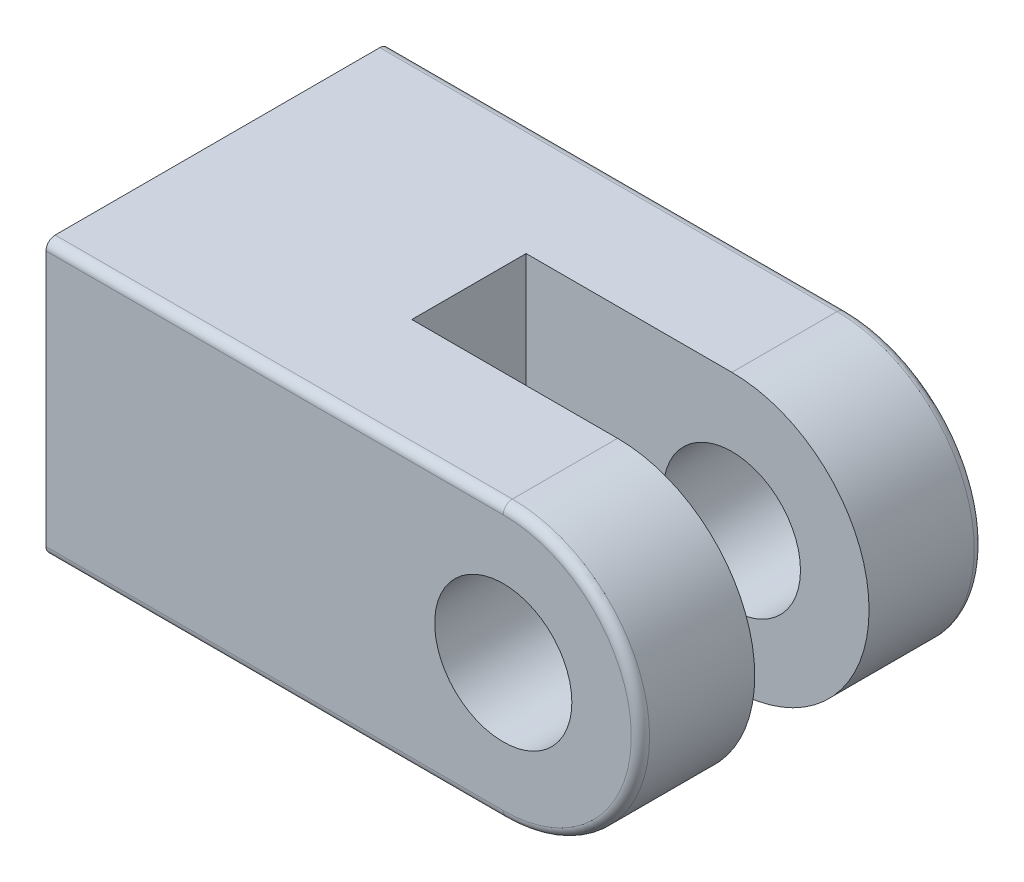
ISO-10303-21;
HEADER;
FILE_DESCRIPTION(('STEP AP214'),'2;1');
FILE_NAME('part.step','',(''),(''),'','','');
FILE_SCHEMA(('AUTOMOTIVE_DESIGN { 1 0 10303 214 1 1 1 1 }'));
ENDSEC;
DATA;
#1=APPLICATION_CONTEXT('core data for automotive mechanical design processes');
#2=APPLICATION_PROTOCOL_DEFINITION('international standard','automotive_design',2000,#1);
#3=PRODUCT_CONTEXT('',#1,'mechanical');
#4=PRODUCT('Part','Part','',(#3));
#5=PRODUCT_RELATED_PRODUCT_CATEGORY('part','',(#4));
#6=PRODUCT_DEFINITION_FORMATION('','',#4);
#7=PRODUCT_DEFINITION_CONTEXT('part definition',#1,'design');
#8=PRODUCT_DEFINITION('design','',#6,#7);
#9=PRODUCT_DEFINITION_SHAPE('','',#8);
#10=(LENGTH_UNIT() NAMED_UNIT(*) SI_UNIT(.MILLI.,.METRE.));
#11=(NAMED_UNIT(*) PLANE_ANGLE_UNIT() SI_UNIT($,.RADIAN.));
#12=(NAMED_UNIT(*) SI_UNIT($,.STERADIAN.) SOLID_ANGLE_UNIT());
#13=UNCERTAINTY_MEASURE_WITH_UNIT(LENGTH_MEASURE(1.E-05),#10,'distance_accuracy_value','');
#14=(GEOMETRIC_REPRESENTATION_CONTEXT(3) GLOBAL_UNCERTAINTY_ASSIGNED_CONTEXT((#13)) GLOBAL_UNIT_ASSIGNED_CONTEXT((#10,
#11,#12)) REPRESENTATION_CONTEXT('',''));
#15=CARTESIAN_POINT('',(0.,0.,0.));
#16=DIRECTION('',(0.,0.,1.));
#17=DIRECTION('',(1.,0.,0.));
#18=AXIS2_PLACEMENT_3D('',#15,#16,#17);
#19=CARTESIAN_POINT('',(0.,0.,19.05));
#20=DIRECTION('',(0.,0.,-1.));
#21=DIRECTION('',(-1.,0.,0.));
#22=AXIS2_PLACEMENT_3D('',#19,#20,#21);
#23=CYLINDRICAL_SURFACE('',#22,7.62);
#24=DIRECTION('',(0.,0.,-1.));
#25=VECTOR('',#24,1.);
#26=CARTESIAN_POINT('',(0.,7.62,19.05));
#27=LINE('',#26,#25);
#28=CARTESIAN_POINT('',(0.,7.62,18.542));
#29=VERTEX_POINT('',#28);
#30=CARTESIAN_POINT('',(0.,7.62,12.7));
#31=VERTEX_POINT('',#30);
#32=EDGE_CURVE('E180',#29,#31,#27,.T.);
#33=ORIENTED_EDGE('',*,*,#32,.F.);
#34=CARTESIAN_POINT('',(0.,0.,18.542));
#35=DIRECTION('',(0.,0.,1.));
#36=DIRECTION('',(1.,0.,0.));
#37=AXIS2_PLACEMENT_3D('',#34,#35,#36);
#38=CIRCLE('',#37,7.62);
#39=CARTESIAN_POINT('',(0.,-7.62,18.542));
#40=VERTEX_POINT('',#39);
#41=EDGE_CURVE('E11',#29,#40,#38,.F.);
#42=ORIENTED_EDGE('',*,*,#41,.T.);
#43=DIRECTION('',(0.,0.,-1.));
#44=VECTOR('',#43,1.);
#45=CARTESIAN_POINT('',(0.,-7.62,19.05));
#46=LINE('',#45,#44);
#47=CARTESIAN_POINT('',(0.,-7.62,12.7));
#48=VERTEX_POINT('',#47);
#49=EDGE_CURVE('E171',#40,#48,#46,.T.);
#50=ORIENTED_EDGE('',*,*,#49,.T.);
#51=CARTESIAN_POINT('',(0.,0.,12.7));
#52=DIRECTION('',(0.,0.,1.));
#53=DIRECTION('',(1.,0.,0.));
#54=AXIS2_PLACEMENT_3D('',#51,#52,#53);
#55=CIRCLE('',#54,7.62);
#56=EDGE_CURVE('E161',#48,#31,#55,.T.);
#57=ORIENTED_EDGE('',*,*,#56,.T.);
#58=EDGE_LOOP('',(#33,#42,#50,#57));
#59=FACE_BOUND('',#58,.T.);
#60=ADVANCED_FACE('F34',(#59),#23,.T.);
#61=CARTESIAN_POINT('',(0.,-7.62,6.35));
#62=VERTEX_POINT('',#61);
#63=CARTESIAN_POINT('',(0.,-7.62,0.508000000000008));
#64=VERTEX_POINT('',#63);
#65=EDGE_CURVE('E168',#62,#64,#46,.T.);
#66=ORIENTED_EDGE('',*,*,#65,.T.);
#67=CARTESIAN_POINT('',(0.,0.,0.508000000000002));
#68=DIRECTION('',(0.,0.,1.));
#69=DIRECTION('',(1.,0.,0.));
#70=AXIS2_PLACEMENT_3D('',#67,#68,#69);
#71=CIRCLE('',#70,7.62);
#72=CARTESIAN_POINT('',(0.,7.62,0.508000000000008));
#73=VERTEX_POINT('',#72);
#74=EDGE_CURVE('E43',#64,#73,#71,.T.);
#75=ORIENTED_EDGE('',*,*,#74,.T.);
#76=CARTESIAN_POINT('',(0.,7.62,6.35));
#77=VERTEX_POINT('',#76);
#78=EDGE_CURVE('E179',#77,#73,#27,.T.);
#79=ORIENTED_EDGE('',*,*,#78,.F.);
#80=CARTESIAN_POINT('',(0.,0.,6.35));
#81=DIRECTION('',(0.,0.,-1.));
#82=DIRECTION('',(-1.,0.,0.));
#83=AXIS2_PLACEMENT_3D('',#80,#81,#82);
#84=CIRCLE('',#83,7.62);
#85=EDGE_CURVE('E132',#77,#62,#84,.T.);
#86=ORIENTED_EDGE('',*,*,#85,.T.);
#87=EDGE_LOOP('',(#66,#75,#79,#86));
#88=FACE_BOUND('',#87,.T.);
#89=ADVANCED_FACE('F252',(#88),#23,.T.);
#90=CARTESIAN_POINT('',(0.,7.62,19.05));
#91=DIRECTION('',(0.,-1.,0.));
#92=DIRECTION('',(1.,0.,0.));
#93=AXIS2_PLACEMENT_3D('',#90,#91,#92);
#94=PLANE('',#93);
#95=ORIENTED_EDGE('',*,*,#78,.T.);
#96=DIRECTION('',(-1.,0.,0.));
#97=VECTOR('',#96,1.);
#98=CARTESIAN_POINT('',(0.,7.62,0.508000000000002));
#99=LINE('',#98,#97);
#100=CARTESIAN_POINT('',(-25.4,7.62,0.508000000000008));
#101=VERTEX_POINT('',#100);
#102=EDGE_CURVE('E209',#73,#101,#99,.T.);
#103=ORIENTED_EDGE('',*,*,#102,.T.);
#104=DIRECTION('',(0.,0.,-1.));
#105=VECTOR('',#104,1.);
#106=CARTESIAN_POINT('',(-25.4,7.62,19.05));
#107=LINE('',#106,#105);
#108=CARTESIAN_POINT('',(-25.4,7.62,18.542));
#109=VERTEX_POINT('',#108);
#110=EDGE_CURVE('E176',#109,#101,#107,.T.);
#111=ORIENTED_EDGE('',*,*,#110,.F.);
#112=DIRECTION('',(-1.,0.,0.));
#113=VECTOR('',#112,1.);
#114=CARTESIAN_POINT('',(0.,7.62,18.542));
#115=LINE('',#114,#113);
#116=EDGE_CURVE('E207',#109,#29,#115,.F.);
#117=ORIENTED_EDGE('',*,*,#116,.T.);
#118=ORIENTED_EDGE('',*,*,#32,.T.);
#119=DIRECTION('',(1.,0.,0.));
#120=VECTOR('',#119,1.);
#121=CARTESIAN_POINT('',(-11.43,7.62,12.7));
#122=LINE('',#121,#120);
#123=CARTESIAN_POINT('',(-11.43,7.62,12.7));
#124=VERTEX_POINT('',#123);
#125=EDGE_CURVE('E151',#124,#31,#122,.T.);
#126=ORIENTED_EDGE('',*,*,#125,.F.);
#127=DIRECTION('',(0.,0.,1.));
#128=VECTOR('',#127,1.);
#129=CARTESIAN_POINT('',(-11.43,7.62,6.35));
#130=LINE('',#129,#128);
#131=CARTESIAN_POINT('',(-11.43,7.62,6.35));
#132=VERTEX_POINT('',#131);
#133=EDGE_CURVE('E137',#132,#124,#130,.T.);
#134=ORIENTED_EDGE('',*,*,#133,.F.);
#135=DIRECTION('',(-1.,0.,0.));
#136=VECTOR('',#135,1.);
#137=CARTESIAN_POINT('',(7.62,7.62,6.35));
#138=LINE('',#137,#136);
#139=EDGE_CURVE('E126',#77,#132,#138,.T.);
#140=ORIENTED_EDGE('',*,*,#139,.F.);
#141=EDGE_LOOP('',(#95,#103,#111,#117,#118,#126,#134,#140));
#142=FACE_BOUND('',#141,.T.);
#143=ADVANCED_FACE('F149',(#142),#94,.F.);
#144=CARTESIAN_POINT('',(-25.4,7.62,19.05));
#145=DIRECTION('',(1.,0.,0.));
#146=DIRECTION('',(0.,0.,-1.));
#147=AXIS2_PLACEMENT_3D('',#144,#145,#146);
#148=PLANE('',#147);
#149=DIRECTION('',(0.,-1.,0.));
#150=VECTOR('',#149,1.);
#151=CARTESIAN_POINT('',(-25.4,7.62,0.));
#152=LINE('',#151,#150);
#153=CARTESIAN_POINT('',(-25.4,7.112,0.));
#154=VERTEX_POINT('',#153);
#155=CARTESIAN_POINT('',(-25.4,-7.112,0.));
#156=VERTEX_POINT('',#155);
#157=EDGE_CURVE('E164',#154,#156,#152,.T.);
#158=ORIENTED_EDGE('',*,*,#157,.T.);
#159=CARTESIAN_POINT('',(-25.4,-7.112,0.508000000000002));
#160=DIRECTION('',(1.,0.,0.));
#161=DIRECTION('',(0.,0.,-1.));
#162=AXIS2_PLACEMENT_3D('',#159,#160,#161);
#163=CIRCLE('',#162,0.508);
#164=CARTESIAN_POINT('',(-25.4,-7.62,0.508000000000008));
#165=VERTEX_POINT('',#164);
#166=EDGE_CURVE('E205',#156,#165,#163,.F.);
#167=ORIENTED_EDGE('',*,*,#166,.T.);
#168=DIRECTION('',(0.,0.,-1.));
#169=VECTOR('',#168,1.);
#170=CARTESIAN_POINT('',(-25.4,-7.62,19.05));
#171=LINE('',#170,#169);
#172=CARTESIAN_POINT('',(-25.4,-7.62,18.542));
#173=VERTEX_POINT('',#172);
#174=EDGE_CURVE('E173',#173,#165,#171,.T.);
#175=ORIENTED_EDGE('',*,*,#174,.F.);
#176=CARTESIAN_POINT('',(-25.4,-7.112,18.542));
#177=DIRECTION('',(1.,0.,0.));
#178=DIRECTION('',(0.,0.,-1.));
#179=AXIS2_PLACEMENT_3D('',#176,#177,#178);
#180=CIRCLE('',#179,0.508);
#181=CARTESIAN_POINT('',(-25.4,-7.112,19.05));
#182=VERTEX_POINT('',#181);
#183=EDGE_CURVE('E201',#173,#182,#180,.F.);
#184=ORIENTED_EDGE('',*,*,#183,.T.);
#185=DIRECTION('',(0.,-1.,0.));
#186=VECTOR('',#185,1.);
#187=CARTESIAN_POINT('',(-25.4,7.62,19.05));
#188=LINE('',#187,#186);
#189=CARTESIAN_POINT('',(-25.4,7.112,19.05));
#190=VERTEX_POINT('',#189);
#191=EDGE_CURVE('E165',#190,#182,#188,.T.);
#192=ORIENTED_EDGE('',*,*,#191,.F.);
#193=CARTESIAN_POINT('',(-25.4,7.112,18.542));
#194=DIRECTION('',(1.,0.,0.));
#195=DIRECTION('',(0.,0.,-1.));
#196=AXIS2_PLACEMENT_3D('',#193,#194,#195);
#197=CIRCLE('',#196,0.508);
#198=EDGE_CURVE('E199',#190,#109,#197,.F.);
#199=ORIENTED_EDGE('',*,*,#198,.T.);
#200=ORIENTED_EDGE('',*,*,#110,.T.);
#201=CARTESIAN_POINT('',(-25.4,7.112,0.508000000000002));
#202=DIRECTION('',(1.,0.,0.));
#203=DIRECTION('',(0.,0.,-1.));
#204=AXIS2_PLACEMENT_3D('',#201,#202,#203);
#205=CIRCLE('',#204,0.508);
#206=EDGE_CURVE('E203',#101,#154,#205,.F.);
#207=ORIENTED_EDGE('',*,*,#206,.T.);
#208=EDGE_LOOP('',(#158,#167,#175,#184,#192,#199,#200,#207));
#209=FACE_BOUND('',#208,.T.);
#210=ADVANCED_FACE('F234',(#209),#148,.F.);
#211=CARTESIAN_POINT('',(-25.4,-7.62,19.05));
#212=DIRECTION('',(0.,1.,0.));
#213=DIRECTION('',(0.,0.,1.));
#214=AXIS2_PLACEMENT_3D('',#211,#212,#213);
#215=PLANE('',#214);
#216=ORIENTED_EDGE('',*,*,#174,.T.);
#217=DIRECTION('',(1.,0.,0.));
#218=VECTOR('',#217,1.);
#219=CARTESIAN_POINT('',(-25.4,-7.62,0.508000000000002));
#220=LINE('',#219,#218);
#221=EDGE_CURVE('E190',#165,#64,#220,.T.);
#222=ORIENTED_EDGE('',*,*,#221,.T.);
#223=ORIENTED_EDGE('',*,*,#65,.F.);
#224=DIRECTION('',(-1.,0.,0.));
#225=VECTOR('',#224,1.);
#226=CARTESIAN_POINT('',(-25.4,-7.62,6.35));
#227=LINE('',#226,#225);
#228=CARTESIAN_POINT('',(-11.43,-7.62,6.35));
#229=VERTEX_POINT('',#228);
#230=EDGE_CURVE('E182',#62,#229,#227,.T.);
#231=ORIENTED_EDGE('',*,*,#230,.T.);
#232=DIRECTION('',(0.,0.,1.));
#233=VECTOR('',#232,1.);
#234=CARTESIAN_POINT('',(-11.43,-7.62,6.35));
#235=LINE('',#234,#233);
#236=CARTESIAN_POINT('',(-11.43,-7.62,12.7));
#237=VERTEX_POINT('',#236);
#238=EDGE_CURVE('E145',#229,#237,#235,.T.);
#239=ORIENTED_EDGE('',*,*,#238,.T.);
#240=DIRECTION('',(1.,0.,0.));
#241=VECTOR('',#240,1.);
#242=CARTESIAN_POINT('',(-11.43,-7.62,12.7));
#243=LINE('',#242,#241);
#244=EDGE_CURVE('E147',#237,#48,#243,.T.);
#245=ORIENTED_EDGE('',*,*,#244,.T.);
#246=ORIENTED_EDGE('',*,*,#49,.F.);
#247=DIRECTION('',(1.,0.,0.));
#248=VECTOR('',#247,1.);
#249=CARTESIAN_POINT('',(-25.4,-7.62,18.542));
#250=LINE('',#249,#248);
#251=EDGE_CURVE('E184',#40,#173,#250,.F.);
#252=ORIENTED_EDGE('',*,*,#251,.T.);
#253=EDGE_LOOP('',(#216,#222,#223,#231,#239,#245,#246,#252));
#254=FACE_BOUND('',#253,.T.);
#255=ADVANCED_FACE('F241',(#254),#215,.F.);
#256=CARTESIAN_POINT('',(0.,0.,19.05));
#257=DIRECTION('',(0.,0.,1.));
#258=DIRECTION('',(1.,0.,0.));
#259=AXIS2_PLACEMENT_3D('',#256,#257,#258);
#260=PLANE('',#259);
#261=ORIENTED_EDGE('',*,*,#191,.T.);
#262=DIRECTION('',(1.,0.,0.));
#263=VECTOR('',#262,1.);
#264=CARTESIAN_POINT('',(0.,-7.112,19.05));
#265=LINE('',#264,#263);
#266=CARTESIAN_POINT('',(0.,-7.112,19.05));
#267=VERTEX_POINT('',#266);
#268=EDGE_CURVE('E214',#182,#267,#265,.T.);
#269=ORIENTED_EDGE('',*,*,#268,.T.);
#270=CARTESIAN_POINT('',(0.,0.,19.05));
#271=DIRECTION('',(0.,0.,1.));
#272=DIRECTION('',(1.,0.,0.));
#273=AXIS2_PLACEMENT_3D('',#270,#271,#272);
#274=CIRCLE('',#273,7.112);
#275=CARTESIAN_POINT('',(0.,7.112,19.05));
#276=VERTEX_POINT('',#275);
#277=EDGE_CURVE('E51',#267,#276,#274,.T.);
#278=ORIENTED_EDGE('',*,*,#277,.T.);
#279=DIRECTION('',(-1.,0.,0.));
#280=VECTOR('',#279,1.);
#281=CARTESIAN_POINT('',(-25.4,7.112,19.05));
#282=LINE('',#281,#280);
#283=EDGE_CURVE('E212',#276,#190,#282,.T.);
#284=ORIENTED_EDGE('',*,*,#283,.T.);
#285=EDGE_LOOP('',(#261,#269,#278,#284));
#286=FACE_BOUND('',#285,.T.);
#287=CARTESIAN_POINT('',(0.,0.,19.05));
#288=DIRECTION('',(0.,0.,1.));
#289=DIRECTION('',(1.,0.,0.));
#290=AXIS2_PLACEMENT_3D('',#287,#288,#289);
#291=CIRCLE('',#290,3.81);
#292=CARTESIAN_POINT('',(3.81,0.,19.05));
#293=VERTEX_POINT('',#292);
#294=EDGE_CURVE('E221',#293,#293,#291,.T.);
#295=ORIENTED_EDGE('',*,*,#294,.F.);
#296=EDGE_LOOP('',(#295));
#297=FACE_BOUND('',#296,.T.);
#298=ADVANCED_FACE('F231',(#286,#297),#260,.T.);
#299=CARTESIAN_POINT('',(0.,0.,0.));
#300=DIRECTION('',(0.,0.,1.));
#301=DIRECTION('',(1.,0.,0.));
#302=AXIS2_PLACEMENT_3D('',#299,#300,#301);
#303=PLANE('',#302);
#304=CARTESIAN_POINT('',(0.,0.,0.));
#305=DIRECTION('',(0.,0.,1.));
#306=DIRECTION('',(1.,0.,0.));
#307=AXIS2_PLACEMENT_3D('',#304,#305,#306);
#308=CIRCLE('',#307,3.81);
#309=CARTESIAN_POINT('',(3.81,0.,0.));
#310=VERTEX_POINT('',#309);
#311=EDGE_CURVE('E188',#310,#310,#308,.T.);
#312=ORIENTED_EDGE('',*,*,#311,.T.);
#313=EDGE_LOOP('',(#312));
#314=FACE_BOUND('',#313,.T.);
#315=CARTESIAN_POINT('',(0.,0.,0.));
#316=DIRECTION('',(0.,0.,1.));
#317=DIRECTION('',(1.,0.,0.));
#318=AXIS2_PLACEMENT_3D('',#315,#316,#317);
#319=CIRCLE('',#318,7.112);
#320=CARTESIAN_POINT('',(0.,7.112,0.));
#321=VERTEX_POINT('',#320);
#322=CARTESIAN_POINT('',(0.,-7.112,0.));
#323=VERTEX_POINT('',#322);
#324=EDGE_CURVE('E193',#321,#323,#319,.F.);
#325=ORIENTED_EDGE('',*,*,#324,.T.);
#326=DIRECTION('',(1.,0.,0.));
#327=VECTOR('',#326,1.);
#328=CARTESIAN_POINT('',(0.,-7.112,0.));
#329=LINE('',#328,#327);
#330=EDGE_CURVE('E197',#323,#156,#329,.F.);
#331=ORIENTED_EDGE('',*,*,#330,.T.);
#332=ORIENTED_EDGE('',*,*,#157,.F.);
#333=DIRECTION('',(-1.,0.,0.));
#334=VECTOR('',#333,1.);
#335=CARTESIAN_POINT('',(0.,7.112,0.));
#336=LINE('',#335,#334);
#337=EDGE_CURVE('E195',#154,#321,#336,.F.);
#338=ORIENTED_EDGE('',*,*,#337,.T.);
#339=EDGE_LOOP('',(#325,#331,#332,#338));
#340=FACE_BOUND('',#339,.T.);
#341=ADVANCED_FACE('F266',(#314,#340),#303,.F.);
#342=CARTESIAN_POINT('',(-11.43,-7.62,12.7));
#343=DIRECTION('',(0.,0.,1.));
#344=DIRECTION('',(1.,0.,0.));
#345=AXIS2_PLACEMENT_3D('',#342,#343,#344);
#346=PLANE('',#345);
#347=CARTESIAN_POINT('',(0.,0.,12.7));
#348=DIRECTION('',(0.,0.,1.));
#349=DIRECTION('',(1.,0.,0.));
#350=AXIS2_PLACEMENT_3D('',#347,#348,#349);
#351=CIRCLE('',#350,3.81);
#352=CARTESIAN_POINT('',(3.81,0.,12.7));
#353=VERTEX_POINT('',#352);
#354=EDGE_CURVE('E138',#353,#353,#351,.T.);
#355=ORIENTED_EDGE('',*,*,#354,.T.);
#356=EDGE_LOOP('',(#355));
#357=FACE_BOUND('',#356,.T.);
#358=ORIENTED_EDGE('',*,*,#56,.F.);
#359=ORIENTED_EDGE('',*,*,#244,.F.);
#360=DIRECTION('',(0.,1.,0.));
#361=VECTOR('',#360,1.);
#362=CARTESIAN_POINT('',(-11.43,-7.62,12.7));
#363=LINE('',#362,#361);
#364=EDGE_CURVE('E146',#237,#124,#363,.T.);
#365=ORIENTED_EDGE('',*,*,#364,.T.);
#366=ORIENTED_EDGE('',*,*,#125,.T.);
#367=EDGE_LOOP('',(#358,#359,#365,#366));
#368=FACE_BOUND('',#367,.T.);
#369=ADVANCED_FACE('F248',(#357,#368),#346,.F.);
#370=CARTESIAN_POINT('',(7.62,-7.62,6.35));
#371=DIRECTION('',(0.,0.,-1.));
#372=DIRECTION('',(-1.,0.,0.));
#373=AXIS2_PLACEMENT_3D('',#370,#371,#372);
#374=PLANE('',#373);
#375=CARTESIAN_POINT('',(0.,0.,6.35));
#376=DIRECTION('',(0.,0.,-1.));
#377=DIRECTION('',(-1.,0.,0.));
#378=AXIS2_PLACEMENT_3D('',#375,#376,#377);
#379=CIRCLE('',#378,3.81);
#380=CARTESIAN_POINT('',(3.81,0.,6.35));
#381=VERTEX_POINT('',#380);
#382=EDGE_CURVE('E185',#381,#381,#379,.T.);
#383=ORIENTED_EDGE('',*,*,#382,.T.);
#384=EDGE_LOOP('',(#383));
#385=FACE_BOUND('',#384,.T.);
#386=ORIENTED_EDGE('',*,*,#139,.T.);
#387=DIRECTION('',(0.,1.,0.));
#388=VECTOR('',#387,1.);
#389=CARTESIAN_POINT('',(-11.43,-7.62,6.35));
#390=LINE('',#389,#388);
#391=EDGE_CURVE('E130',#229,#132,#390,.T.);
#392=ORIENTED_EDGE('',*,*,#391,.F.);
#393=ORIENTED_EDGE('',*,*,#230,.F.);
#394=ORIENTED_EDGE('',*,*,#85,.F.);
#395=EDGE_LOOP('',(#386,#392,#393,#394));
#396=FACE_BOUND('',#395,.T.);
#397=ADVANCED_FACE('F128',(#385,#396),#374,.F.);
#398=CARTESIAN_POINT('',(-11.43,-7.62,6.35));
#399=DIRECTION('',(-1.,0.,0.));
#400=DIRECTION('',(0.,0.,1.));
#401=AXIS2_PLACEMENT_3D('',#398,#399,#400);
#402=PLANE('',#401);
#403=ORIENTED_EDGE('',*,*,#364,.F.);
#404=ORIENTED_EDGE('',*,*,#238,.F.);
#405=ORIENTED_EDGE('',*,*,#391,.T.);
#406=ORIENTED_EDGE('',*,*,#133,.T.);
#407=EDGE_LOOP('',(#403,#404,#405,#406));
#408=FACE_BOUND('',#407,.T.);
#409=ADVANCED_FACE('F142',(#408),#402,.F.);
#410=CARTESIAN_POINT('',(0.,0.,0.));
#411=DIRECTION('',(0.,0.,1.));
#412=DIRECTION('',(1.,0.,0.));
#413=AXIS2_PLACEMENT_3D('',#410,#411,#412);
#414=CYLINDRICAL_SURFACE('',#413,3.81);
#415=CARTESIAN_POINT('',(3.81,0.,0.));
#416=CARTESIAN_POINT('',(3.81,0.,0.0661458333333333));
#417=CARTESIAN_POINT('',(3.81,0.,0.132291666666667));
#418=CARTESIAN_POINT('',(3.81,0.,0.264583333333333));
#419=CARTESIAN_POINT('',(3.81,0.,0.330729166666667));
#420=CARTESIAN_POINT('',(3.81,0.,0.463020833333333));
#421=CARTESIAN_POINT('',(3.81,0.,0.529166666666667));
#422=CARTESIAN_POINT('',(3.81,0.,0.661458333333333));
#423=CARTESIAN_POINT('',(3.81,0.,0.727604166666667));
#424=CARTESIAN_POINT('',(3.81,0.,0.859895833333333));
#425=CARTESIAN_POINT('',(3.81,0.,0.926041666666667));
#426=CARTESIAN_POINT('',(3.81,0.,1.05833333333333));
#427=CARTESIAN_POINT('',(3.81,0.,1.12447916666667));
#428=CARTESIAN_POINT('',(3.81,0.,1.25677083333333));
#429=CARTESIAN_POINT('',(3.81,0.,1.32291666666667));
#430=CARTESIAN_POINT('',(3.81,0.,1.45520833333333));
#431=CARTESIAN_POINT('',(3.81,0.,1.52135416666667));
#432=CARTESIAN_POINT('',(3.81,0.,1.65364583333333));
#433=CARTESIAN_POINT('',(3.81,0.,1.71979166666667));
#434=CARTESIAN_POINT('',(3.81,0.,1.85208333333333));
#435=CARTESIAN_POINT('',(3.81,0.,1.91822916666667));
#436=CARTESIAN_POINT('',(3.81,0.,2.05052083333333));
#437=CARTESIAN_POINT('',(3.81,0.,2.11666666666667));
#438=CARTESIAN_POINT('',(3.81,0.,2.24895833333333));
#439=CARTESIAN_POINT('',(3.81,0.,2.31510416666667));
#440=CARTESIAN_POINT('',(3.81,0.,2.44739583333333));
#441=CARTESIAN_POINT('',(3.81,0.,2.51354166666667));
#442=CARTESIAN_POINT('',(3.81,0.,2.64583333333333));
#443=CARTESIAN_POINT('',(3.81,0.,2.71197916666667));
#444=CARTESIAN_POINT('',(3.81,0.,2.84427083333333));
#445=CARTESIAN_POINT('',(3.81,0.,2.91041666666667));
#446=CARTESIAN_POINT('',(3.81,0.,3.04270833333333));
#447=CARTESIAN_POINT('',(3.81,0.,3.10885416666667));
#448=CARTESIAN_POINT('',(3.81,0.,3.24114583333333));
#449=CARTESIAN_POINT('',(3.81,0.,3.30729166666667));
#450=CARTESIAN_POINT('',(3.81,0.,3.43958333333333));
#451=CARTESIAN_POINT('',(3.81,0.,3.50572916666667));
#452=CARTESIAN_POINT('',(3.81,0.,3.63802083333333));
#453=CARTESIAN_POINT('',(3.81,0.,3.70416666666667));
#454=CARTESIAN_POINT('',(3.81,0.,3.83645833333333));
#455=CARTESIAN_POINT('',(3.81,0.,3.90260416666667));
#456=CARTESIAN_POINT('',(3.81,0.,4.03489583333333));
#457=CARTESIAN_POINT('',(3.81,0.,4.10104166666667));
#458=CARTESIAN_POINT('',(3.81,0.,4.23333333333333));
#459=CARTESIAN_POINT('',(3.81,0.,4.29947916666667));
#460=CARTESIAN_POINT('',(3.81,0.,4.43177083333333));
#461=CARTESIAN_POINT('',(3.81,0.,4.49791666666667));
#462=CARTESIAN_POINT('',(3.81,0.,4.63020833333333));
#463=CARTESIAN_POINT('',(3.81,0.,4.69635416666667));
#464=CARTESIAN_POINT('',(3.81,0.,4.82864583333333));
#465=CARTESIAN_POINT('',(3.81,0.,4.89479166666667));
#466=CARTESIAN_POINT('',(3.81,0.,5.02708333333333));
#467=CARTESIAN_POINT('',(3.81,0.,5.09322916666667));
#468=CARTESIAN_POINT('',(3.81,0.,5.22552083333333));
#469=CARTESIAN_POINT('',(3.81,0.,5.29166666666667));
#470=CARTESIAN_POINT('',(3.81,0.,5.42395833333333));
#471=CARTESIAN_POINT('',(3.81,0.,5.49010416666667));
#472=CARTESIAN_POINT('',(3.81,0.,5.62239583333333));
#473=CARTESIAN_POINT('',(3.81,0.,5.68854166666667));
#474=CARTESIAN_POINT('',(3.81,0.,5.82083333333333));
#475=CARTESIAN_POINT('',(3.81,0.,5.88697916666667));
#476=CARTESIAN_POINT('',(3.81,0.,6.01927083333333));
#477=CARTESIAN_POINT('',(3.81,0.,6.08541666666667));
#478=CARTESIAN_POINT('',(3.81,0.,6.21770833333333));
#479=CARTESIAN_POINT('',(3.81,0.,6.28385416666667));
#480=CARTESIAN_POINT('',(3.81,0.,6.35));
#481=B_SPLINE_CURVE_WITH_KNOTS('',3,(#415,#416,#417,#418,#419,#420,#421,#422,#423,#424,#425,
#426,#427,#428,#429,#430,#431,#432,#433,#434,#435,#436,#437,#438,#439,#440,#441,#442,#443,#444,
#445,#446,#447,#448,#449,#450,#451,#452,#453,#454,#455,#456,#457,#458,#459,#460,#461,#462,#463,
#464,#465,#466,#467,#468,#469,#470,#471,#472,#473,#474,#475,#476,#477,#478,#479,#480),
.UNSPECIFIED.,.F.,.F.,(4,2,2,2,2,2,2,2,2,2,2,2,2,2,2,2,2,2,2,2,2,2,2,2,2,2,2,2,2,2,2,2,4),(0.,
0.1984375,0.396875,0.5953125,0.79375,0.9921875,1.190625,1.3890625,1.5875,1.7859375,1.984375,
2.1828125,2.38125,2.5796875,2.778125,2.9765625,3.175,3.3734375,3.571875,3.7703125,3.96875,
4.1671875,4.365625,4.5640625,4.7625,4.9609375,5.159375,5.3578125,5.55625,5.7546875,5.953125,
6.1515625,6.35),.UNSPECIFIED.);
#482=EDGE_CURVE('BSEAM300',#310,#381,#481,.T.);
#483=ORIENTED_EDGE('',*,*,#311,.F.);
#484=ORIENTED_EDGE('',*,*,#382,.F.);
#485=ORIENTED_EDGE('',*,*,#482,.T.);
#486=ORIENTED_EDGE('',*,*,#482,.F.);
#487=EDGE_LOOP('',(#483,#485,#484,#486));
#488=FACE_BOUND('',#487,.T.);
#489=ADVANCED_FACE('F300',(#488),#414,.F.);
#490=CARTESIAN_POINT('',(3.81,0.,19.05));
#491=CARTESIAN_POINT('',(3.81,0.,18.9838541666667));
#492=CARTESIAN_POINT('',(3.81,0.,18.9177083333333));
#493=CARTESIAN_POINT('',(3.81,0.,18.7854166666667));
#494=CARTESIAN_POINT('',(3.81,0.,18.7192708333333));
#495=CARTESIAN_POINT('',(3.81,0.,18.5869791666667));
#496=CARTESIAN_POINT('',(3.81,0.,18.5208333333333));
#497=CARTESIAN_POINT('',(3.81,0.,18.3885416666667));
#498=CARTESIAN_POINT('',(3.81,0.,18.3223958333333));
#499=CARTESIAN_POINT('',(3.81,0.,18.1901041666667));
#500=CARTESIAN_POINT('',(3.81,0.,18.1239583333333));
#501=CARTESIAN_POINT('',(3.81,0.,17.9916666666667));
#502=CARTESIAN_POINT('',(3.81,0.,17.9255208333333));
#503=CARTESIAN_POINT('',(3.81,0.,17.7932291666667));
#504=CARTESIAN_POINT('',(3.81,0.,17.7270833333333));
#505=CARTESIAN_POINT('',(3.81,0.,17.5947916666667));
#506=CARTESIAN_POINT('',(3.81,0.,17.5286458333333));
#507=CARTESIAN_POINT('',(3.81,0.,17.3963541666667));
#508=CARTESIAN_POINT('',(3.81,0.,17.3302083333333));
#509=CARTESIAN_POINT('',(3.81,0.,17.1979166666667));
#510=CARTESIAN_POINT('',(3.81,0.,17.1317708333333));
#511=CARTESIAN_POINT('',(3.81,0.,16.9994791666667));
#512=CARTESIAN_POINT('',(3.81,0.,16.9333333333333));
#513=CARTESIAN_POINT('',(3.81,0.,16.8010416666667));
#514=CARTESIAN_POINT('',(3.81,0.,16.7348958333333));
#515=CARTESIAN_POINT('',(3.81,0.,16.6026041666667));
#516=CARTESIAN_POINT('',(3.81,0.,16.5364583333333));
#517=CARTESIAN_POINT('',(3.81,0.,16.4041666666667));
#518=CARTESIAN_POINT('',(3.81,0.,16.3380208333333));
#519=CARTESIAN_POINT('',(3.81,0.,16.2057291666667));
#520=CARTESIAN_POINT('',(3.81,0.,16.1395833333333));
#521=CARTESIAN_POINT('',(3.81,0.,16.0072916666667));
#522=CARTESIAN_POINT('',(3.81,0.,15.9411458333333));
#523=CARTESIAN_POINT('',(3.81,0.,15.8088541666667));
#524=CARTESIAN_POINT('',(3.81,0.,15.7427083333333));
#525=CARTESIAN_POINT('',(3.81,0.,15.6104166666667));
#526=CARTESIAN_POINT('',(3.81,0.,15.5442708333333));
#527=CARTESIAN_POINT('',(3.81,0.,15.4119791666667));
#528=CARTESIAN_POINT('',(3.81,0.,15.3458333333333));
#529=CARTESIAN_POINT('',(3.81,0.,15.2135416666667));
#530=CARTESIAN_POINT('',(3.81,0.,15.1473958333333));
#531=CARTESIAN_POINT('',(3.81,0.,15.0151041666667));
#532=CARTESIAN_POINT('',(3.81,0.,14.9489583333333));
#533=CARTESIAN_POINT('',(3.81,0.,14.8166666666667));
#534=CARTESIAN_POINT('',(3.81,0.,14.7505208333333));
#535=CARTESIAN_POINT('',(3.81,0.,14.6182291666667));
#536=CARTESIAN_POINT('',(3.81,0.,14.5520833333333));
#537=CARTESIAN_POINT('',(3.81,0.,14.4197916666667));
#538=CARTESIAN_POINT('',(3.81,0.,14.3536458333333));
#539=CARTESIAN_POINT('',(3.81,0.,14.2213541666667));
#540=CARTESIAN_POINT('',(3.81,0.,14.1552083333333));
#541=CARTESIAN_POINT('',(3.81,0.,14.0229166666667));
#542=CARTESIAN_POINT('',(3.81,0.,13.9567708333333));
#543=CARTESIAN_POINT('',(3.81,0.,13.8244791666667));
#544=CARTESIAN_POINT('',(3.81,0.,13.7583333333333));
#545=CARTESIAN_POINT('',(3.81,0.,13.6260416666667));
#546=CARTESIAN_POINT('',(3.81,0.,13.5598958333333));
#547=CARTESIAN_POINT('',(3.81,0.,13.4276041666667));
#548=CARTESIAN_POINT('',(3.81,0.,13.3614583333333));
#549=CARTESIAN_POINT('',(3.81,0.,13.2291666666667));
#550=CARTESIAN_POINT('',(3.81,0.,13.1630208333333));
#551=CARTESIAN_POINT('',(3.81,0.,13.0307291666667));
#552=CARTESIAN_POINT('',(3.81,0.,12.9645833333333));
#553=CARTESIAN_POINT('',(3.81,0.,12.8322916666667));
#554=CARTESIAN_POINT('',(3.81,0.,12.7661458333333));
#555=CARTESIAN_POINT('',(3.81,0.,12.7));
#556=B_SPLINE_CURVE_WITH_KNOTS('',3,(#490,#491,#492,#493,#494,#495,#496,#497,#498,#499,#500,
#501,#502,#503,#504,#505,#506,#507,#508,#509,#510,#511,#512,#513,#514,#515,#516,#517,#518,#519,
#520,#521,#522,#523,#524,#525,#526,#527,#528,#529,#530,#531,#532,#533,#534,#535,#536,#537,#538,
#539,#540,#541,#542,#543,#544,#545,#546,#547,#548,#549,#550,#551,#552,#553,#554,#555),
.UNSPECIFIED.,.F.,.F.,(4,2,2,2,2,2,2,2,2,2,2,2,2,2,2,2,2,2,2,2,2,2,2,2,2,2,2,2,2,2,2,2,4),(0.,
0.198437499999999,0.396875000000001,0.5953125,0.793749999999999,0.992187500000002,1.190625,
1.3890625,1.5875,1.7859375,1.984375,2.1828125,2.38125,2.5796875,2.778125,2.9765625,3.175,
3.3734375,3.571875,3.7703125,3.96875,4.1671875,4.365625,4.5640625,4.7625,4.9609375,5.159375,
5.3578125,5.55625,5.7546875,5.953125,6.1515625,6.35),.UNSPECIFIED.);
#557=EDGE_CURVE('BSEAM304',#293,#353,#556,.T.);
#558=ORIENTED_EDGE('',*,*,#294,.T.);
#559=ORIENTED_EDGE('',*,*,#354,.F.);
#560=ORIENTED_EDGE('',*,*,#557,.T.);
#561=ORIENTED_EDGE('',*,*,#557,.F.);
#562=EDGE_LOOP('',(#558,#560,#559,#561));
#563=FACE_BOUND('',#562,.T.);
#564=ADVANCED_FACE('F304',(#563),#414,.F.);
#565=CARTESIAN_POINT('',(0.,7.112,0.508000000000002));
#566=DIRECTION('',(-1.,0.,0.));
#567=DIRECTION('',(0.,-1.,0.));
#568=AXIS2_PLACEMENT_3D('',#565,#566,#567);
#569=CYLINDRICAL_SURFACE('',#568,0.508);
#570=ORIENTED_EDGE('',*,*,#206,.F.);
#571=ORIENTED_EDGE('',*,*,#102,.F.);
#572=CARTESIAN_POINT('',(0.,7.112,0.508));
#573=DIRECTION('',(1.,0.,0.));
#574=DIRECTION('',(0.,1.,0.));
#575=AXIS2_PLACEMENT_3D('',#572,#573,#574);
#576=CIRCLE('',#575,0.508);
#577=EDGE_CURVE('E219',#321,#73,#576,.T.);
#578=ORIENTED_EDGE('',*,*,#577,.F.);
#579=ORIENTED_EDGE('',*,*,#337,.F.);
#580=EDGE_LOOP('',(#570,#571,#578,#579));
#581=FACE_BOUND('',#580,.T.);
#582=ADVANCED_FACE('F258',(#581),#569,.T.);
#583=CARTESIAN_POINT('',(0.,0.,0.508000000000002));
#584=DIRECTION('',(0.,0.,1.));
#585=DIRECTION('',(1.,0.,0.));
#586=AXIS2_PLACEMENT_3D('',#583,#584,#585);
#587=TOROIDAL_SURFACE('',#586,7.112,0.508);
#588=ORIENTED_EDGE('',*,*,#577,.T.);
#589=ORIENTED_EDGE('',*,*,#74,.F.);
#590=CARTESIAN_POINT('',(0.,-7.112,0.508));
#591=DIRECTION('',(-1.,0.,0.));
#592=DIRECTION('',(0.,0.,1.));
#593=AXIS2_PLACEMENT_3D('',#590,#591,#592);
#594=CIRCLE('',#593,0.508);
#595=EDGE_CURVE('E217',#323,#64,#594,.T.);
#596=ORIENTED_EDGE('',*,*,#595,.F.);
#597=ORIENTED_EDGE('',*,*,#324,.F.);
#598=EDGE_LOOP('',(#588,#589,#596,#597));
#599=FACE_BOUND('',#598,.T.);
#600=ADVANCED_FACE('F262',(#599),#587,.T.);
#601=CARTESIAN_POINT('',(-25.4,-7.112,0.508000000000002));
#602=DIRECTION('',(1.,0.,0.));
#603=DIRECTION('',(0.,0.,-1.));
#604=AXIS2_PLACEMENT_3D('',#601,#602,#603);
#605=CYLINDRICAL_SURFACE('',#604,0.508);
#606=ORIENTED_EDGE('',*,*,#166,.F.);
#607=ORIENTED_EDGE('',*,*,#330,.F.);
#608=ORIENTED_EDGE('',*,*,#595,.T.);
#609=ORIENTED_EDGE('',*,*,#221,.F.);
#610=EDGE_LOOP('',(#606,#607,#608,#609));
#611=FACE_BOUND('',#610,.T.);
#612=ADVANCED_FACE('F270',(#611),#605,.T.);
#613=CARTESIAN_POINT('',(0.,7.112,18.542));
#614=DIRECTION('',(1.,0.,0.));
#615=DIRECTION('',(0.,1.,0.));
#616=AXIS2_PLACEMENT_3D('',#613,#614,#615);
#617=CYLINDRICAL_SURFACE('',#616,0.508);
#618=ORIENTED_EDGE('',*,*,#198,.F.);
#619=ORIENTED_EDGE('',*,*,#283,.F.);
#620=CARTESIAN_POINT('',(0.,7.112,18.542));
#621=DIRECTION('',(1.,0.,0.));
#622=DIRECTION('',(0.,1.,0.));
#623=AXIS2_PLACEMENT_3D('',#620,#621,#622);
#624=CIRCLE('',#623,0.508);
#625=EDGE_CURVE('E38',#29,#276,#624,.T.);
#626=ORIENTED_EDGE('',*,*,#625,.F.);
#627=ORIENTED_EDGE('',*,*,#116,.F.);
#628=EDGE_LOOP('',(#618,#619,#626,#627));
#629=FACE_BOUND('',#628,.T.);
#630=ADVANCED_FACE('F36',(#629),#617,.T.);
#631=CARTESIAN_POINT('',(0.,0.,18.542));
#632=DIRECTION('',(0.,0.,1.));
#633=DIRECTION('',(1.,0.,0.));
#634=AXIS2_PLACEMENT_3D('',#631,#632,#633);
#635=TOROIDAL_SURFACE('',#634,7.112,0.508);
#636=ORIENTED_EDGE('',*,*,#625,.T.);
#637=ORIENTED_EDGE('',*,*,#277,.F.);
#638=CARTESIAN_POINT('',(0.,-7.112,18.542));
#639=DIRECTION('',(-1.,0.,0.));
#640=DIRECTION('',(0.,0.,1.));
#641=AXIS2_PLACEMENT_3D('',#638,#639,#640);
#642=CIRCLE('',#641,0.508);
#643=EDGE_CURVE('E59',#40,#267,#642,.T.);
#644=ORIENTED_EDGE('',*,*,#643,.F.);
#645=ORIENTED_EDGE('',*,*,#41,.F.);
#646=EDGE_LOOP('',(#636,#637,#644,#645));
#647=FACE_BOUND('',#646,.T.);
#648=ADVANCED_FACE('F226',(#647),#635,.T.);
#649=CARTESIAN_POINT('',(0.,-7.112,18.542));
#650=DIRECTION('',(-1.,0.,0.));
#651=DIRECTION('',(0.,0.,1.));
#652=AXIS2_PLACEMENT_3D('',#649,#650,#651);
#653=CYLINDRICAL_SURFACE('',#652,0.508);
#654=ORIENTED_EDGE('',*,*,#183,.F.);
#655=ORIENTED_EDGE('',*,*,#251,.F.);
#656=ORIENTED_EDGE('',*,*,#643,.T.);
#657=ORIENTED_EDGE('',*,*,#268,.F.);
#658=EDGE_LOOP('',(#654,#655,#656,#657));
#659=FACE_BOUND('',#658,.T.);
#660=ADVANCED_FACE('F238',(#659),#653,.T.);
#661=CLOSED_SHELL('',(#60,#89,#143,#210,#255,#298,#341,#369,#397,#409,#489,#564,#582,#600,#612,
#630,#648,#660));
#662=MANIFOLD_SOLID_BREP('B2',#661);
#663=ADVANCED_BREP_SHAPE_REPRESENTATION('',(#18,#662),#14);
#664=SHAPE_DEFINITION_REPRESENTATION(#9,#663);
ENDSEC;
END-ISO-10303-21;
